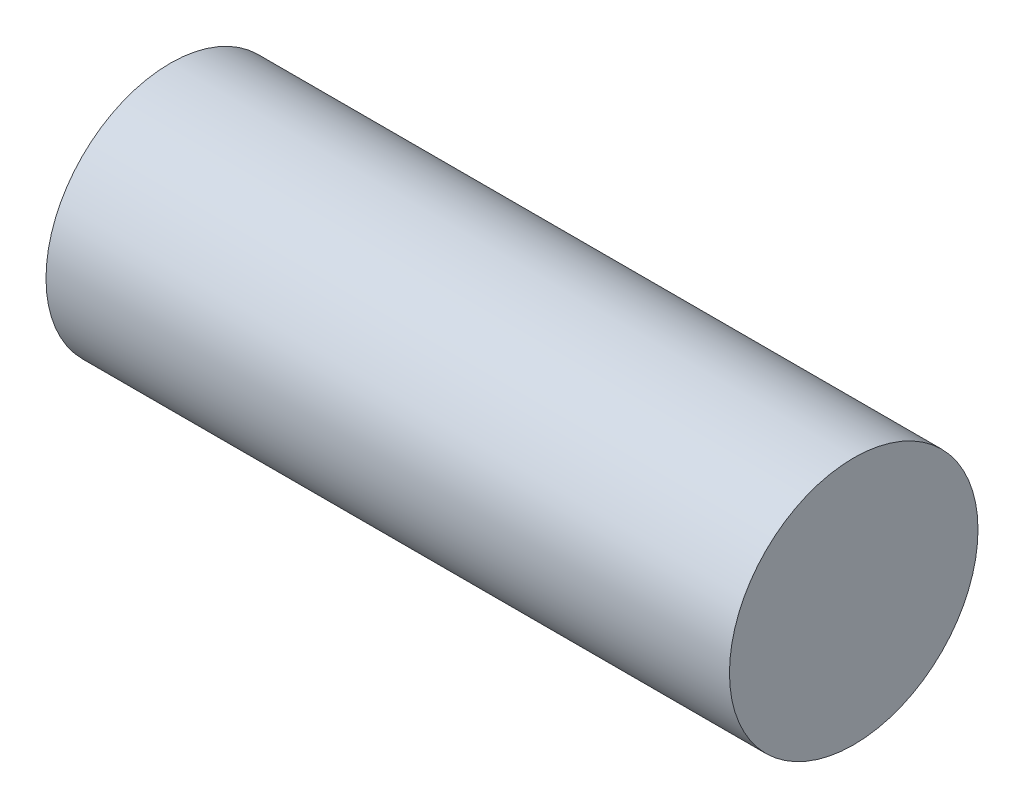
ISO-10303-21;
HEADER;
FILE_DESCRIPTION(('STEP AP214'),'2;1');
FILE_NAME('part.step','',(''),(''),'','','');
FILE_SCHEMA(('AUTOMOTIVE_DESIGN { 1 0 10303 214 1 1 1 1 }'));
ENDSEC;
DATA;
#1=APPLICATION_CONTEXT('core data for automotive mechanical design processes');
#2=APPLICATION_PROTOCOL_DEFINITION('international standard','automotive_design',2000,#1);
#3=PRODUCT_CONTEXT('',#1,'mechanical');
#4=PRODUCT('Part','Part','',(#3));
#5=PRODUCT_RELATED_PRODUCT_CATEGORY('part','',(#4));
#6=PRODUCT_DEFINITION_FORMATION('','',#4);
#7=PRODUCT_DEFINITION_CONTEXT('part definition',#1,'design');
#8=PRODUCT_DEFINITION('design','',#6,#7);
#9=PRODUCT_DEFINITION_SHAPE('','',#8);
#10=(LENGTH_UNIT() NAMED_UNIT(*) SI_UNIT(.MILLI.,.METRE.));
#11=(NAMED_UNIT(*) PLANE_ANGLE_UNIT() SI_UNIT($,.RADIAN.));
#12=(NAMED_UNIT(*) SI_UNIT($,.STERADIAN.) SOLID_ANGLE_UNIT());
#13=UNCERTAINTY_MEASURE_WITH_UNIT(LENGTH_MEASURE(1.E-05),#10,'distance_accuracy_value','');
#14=(GEOMETRIC_REPRESENTATION_CONTEXT(3) GLOBAL_UNCERTAINTY_ASSIGNED_CONTEXT((#13)) GLOBAL_UNIT_ASSIGNED_CONTEXT((#10,
#11,#12)) REPRESENTATION_CONTEXT('',''));
#15=CARTESIAN_POINT('',(0.,0.,0.));
#16=DIRECTION('',(0.,0.,1.));
#17=DIRECTION('',(1.,0.,0.));
#18=AXIS2_PLACEMENT_3D('',#15,#16,#17);
#19=CARTESIAN_POINT('',(22.,0.,0.));
#20=DIRECTION('',(-1.,0.,0.));
#21=DIRECTION('',(0.,0.,1.));
#22=AXIS2_PLACEMENT_3D('',#19,#20,#21);
#23=CYLINDRICAL_SURFACE('',#22,4.);
#24=CARTESIAN_POINT('',(22.,0.,0.));
#25=DIRECTION('',(1.,0.,0.));
#26=DIRECTION('',(0.,0.,-1.));
#27=AXIS2_PLACEMENT_3D('',#24,#25,#26);
#28=CIRCLE('',#27,4.);
#29=CARTESIAN_POINT('',(22.,0.,-4.));
#30=VERTEX_POINT('',#29);
#31=EDGE_CURVE('E10',#30,#30,#28,.T.);
#32=ORIENTED_EDGE('',*,*,#31,.F.);
#33=EDGE_LOOP('',(#32));
#34=FACE_BOUND('',#33,.T.);
#35=CARTESIAN_POINT('',(0.,0.,0.));
#36=DIRECTION('',(1.,0.,0.));
#37=DIRECTION('',(0.,0.,-1.));
#38=AXIS2_PLACEMENT_3D('',#35,#36,#37);
#39=CIRCLE('',#38,4.);
#40=CARTESIAN_POINT('',(0.,0.,-4.));
#41=VERTEX_POINT('',#40);
#42=EDGE_CURVE('E35',#41,#41,#39,.T.);
#43=ORIENTED_EDGE('',*,*,#42,.T.);
#44=EDGE_LOOP('',(#43));
#45=FACE_BOUND('',#44,.T.);
#46=ADVANCED_FACE('F32',(#34,#45),#23,.T.);
#47=CARTESIAN_POINT('',(22.,0.,0.));
#48=DIRECTION('',(1.,0.,0.));
#49=DIRECTION('',(0.,0.,-1.));
#50=AXIS2_PLACEMENT_3D('',#47,#48,#49);
#51=PLANE('',#50);
#52=ORIENTED_EDGE('',*,*,#31,.T.);
#53=EDGE_LOOP('',(#52));
#54=FACE_BOUND('',#53,.T.);
#55=ADVANCED_FACE('F47',(#54),#51,.T.);
#56=CARTESIAN_POINT('',(0.,0.,0.));
#57=DIRECTION('',(1.,0.,0.));
#58=DIRECTION('',(0.,0.,-1.));
#59=AXIS2_PLACEMENT_3D('',#56,#57,#58);
#60=PLANE('',#59);
#61=ORIENTED_EDGE('',*,*,#42,.F.);
#62=EDGE_LOOP('',(#61));
#63=FACE_BOUND('',#62,.T.);
#64=ADVANCED_FACE('F45',(#63),#60,.F.);
#65=CLOSED_SHELL('',(#46,#55,#64));
#66=MANIFOLD_SOLID_BREP('B2',#65);
#67=ADVANCED_BREP_SHAPE_REPRESENTATION('',(#18,#66),#14);
#68=SHAPE_DEFINITION_REPRESENTATION(#9,#67);
ENDSEC;
END-ISO-10303-21;
